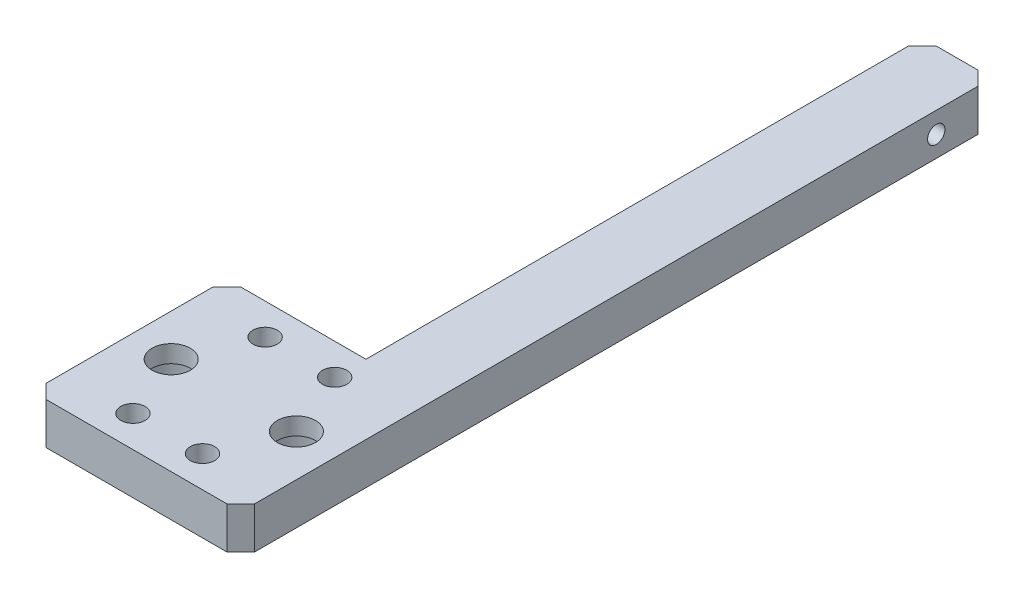
ISO-10303-21;
HEADER;
FILE_DESCRIPTION(('STEP AP214'),'2;1');
FILE_NAME('part.step','',(''),(''),'','','');
FILE_SCHEMA(('AUTOMOTIVE_DESIGN { 1 0 10303 214 1 1 1 1 }'));
ENDSEC;
DATA;
#1=APPLICATION_CONTEXT('core data for automotive mechanical design processes');
#2=APPLICATION_PROTOCOL_DEFINITION('international standard','automotive_design',2000,#1);
#3=PRODUCT_CONTEXT('',#1,'mechanical');
#4=PRODUCT('Part','Part','',(#3));
#5=PRODUCT_RELATED_PRODUCT_CATEGORY('part','',(#4));
#6=PRODUCT_DEFINITION_FORMATION('','',#4);
#7=PRODUCT_DEFINITION_CONTEXT('part definition',#1,'design');
#8=PRODUCT_DEFINITION('design','',#6,#7);
#9=PRODUCT_DEFINITION_SHAPE('','',#8);
#10=(LENGTH_UNIT() NAMED_UNIT(*) SI_UNIT(.MILLI.,.METRE.));
#11=(NAMED_UNIT(*) PLANE_ANGLE_UNIT() SI_UNIT($,.RADIAN.));
#12=(NAMED_UNIT(*) SI_UNIT($,.STERADIAN.) SOLID_ANGLE_UNIT());
#13=UNCERTAINTY_MEASURE_WITH_UNIT(LENGTH_MEASURE(1.E-05),#10,'distance_accuracy_value','');
#14=(GEOMETRIC_REPRESENTATION_CONTEXT(3) GLOBAL_UNCERTAINTY_ASSIGNED_CONTEXT((#13)) GLOBAL_UNIT_ASSIGNED_CONTEXT((#10,
#11,#12)) REPRESENTATION_CONTEXT('',''));
#15=CARTESIAN_POINT('',(0.,0.,0.));
#16=DIRECTION('',(0.,0.,1.));
#17=DIRECTION('',(1.,0.,0.));
#18=AXIS2_PLACEMENT_3D('',#15,#16,#17);
#19=CARTESIAN_POINT('',(9.,-3.5,0.));
#20=DIRECTION('',(0.,1.,0.));
#21=DIRECTION('',(0.,0.,1.));
#22=AXIS2_PLACEMENT_3D('',#19,#20,#21);
#23=CYLINDRICAL_SURFACE('',#22,2.74999999999999);
#24=CARTESIAN_POINT('',(9.,6.,0.));
#25=DIRECTION('',(0.,-1.,0.));
#26=DIRECTION('',(0.,0.,1.));
#27=AXIS2_PLACEMENT_3D('',#24,#25,#26);
#28=CIRCLE('',#27,2.74999999999999);
#29=CARTESIAN_POINT('',(9.,6.,2.75));
#30=VERTEX_POINT('',#29);
#31=EDGE_CURVE('E148',#30,#30,#28,.T.);
#32=ORIENTED_EDGE('',*,*,#31,.F.);
#33=EDGE_LOOP('',(#32));
#34=FACE_BOUND('',#33,.T.);
#35=CARTESIAN_POINT('',(9.,3.5,0.));
#36=DIRECTION('',(0.,-1.,0.));
#37=DIRECTION('',(0.,0.,-1.));
#38=AXIS2_PLACEMENT_3D('',#35,#36,#37);
#39=CIRCLE('',#38,2.74999999999999);
#40=CARTESIAN_POINT('',(9.,3.5,-2.74999999999999));
#41=VERTEX_POINT('',#40);
#42=EDGE_CURVE('E201',#41,#41,#39,.T.);
#43=ORIENTED_EDGE('',*,*,#42,.T.);
#44=EDGE_LOOP('',(#43));
#45=FACE_BOUND('',#44,.T.);
#46=ADVANCED_FACE('F38',(#34,#45),#23,.F.);
#47=CARTESIAN_POINT('',(-9.,-3.5,0.));
#48=DIRECTION('',(0.,1.,0.));
#49=DIRECTION('',(0.,0.,1.));
#50=AXIS2_PLACEMENT_3D('',#47,#48,#49);
#51=CYLINDRICAL_SURFACE('',#50,2.75);
#52=CARTESIAN_POINT('',(-9.,6.,0.));
#53=DIRECTION('',(0.,-1.,0.));
#54=DIRECTION('',(0.,0.,-1.));
#55=AXIS2_PLACEMENT_3D('',#52,#53,#54);
#56=CIRCLE('',#55,2.75);
#57=CARTESIAN_POINT('',(-9.,6.,-2.75));
#58=VERTEX_POINT('',#57);
#59=EDGE_CURVE('E151',#58,#58,#56,.T.);
#60=ORIENTED_EDGE('',*,*,#59,.F.);
#61=EDGE_LOOP('',(#60));
#62=FACE_BOUND('',#61,.T.);
#63=CARTESIAN_POINT('',(-9.,3.5,0.));
#64=DIRECTION('',(0.,-1.,0.));
#65=DIRECTION('',(0.,0.,-1.));
#66=AXIS2_PLACEMENT_3D('',#63,#64,#65);
#67=CIRCLE('',#66,2.75);
#68=CARTESIAN_POINT('',(-9.,3.5,-2.75));
#69=VERTEX_POINT('',#68);
#70=EDGE_CURVE('E198',#69,#69,#67,.T.);
#71=ORIENTED_EDGE('',*,*,#70,.T.);
#72=EDGE_LOOP('',(#71));
#73=FACE_BOUND('',#72,.T.);
#74=ADVANCED_FACE('F305',(#62,#73),#51,.F.);
#75=CARTESIAN_POINT('',(-15.,6.,-14.));
#76=DIRECTION('',(0.,0.,1.));
#77=DIRECTION('',(1.,0.,0.));
#78=AXIS2_PLACEMENT_3D('',#75,#76,#77);
#79=PLANE('',#78);
#80=DIRECTION('',(-1.,0.,0.));
#81=VECTOR('',#80,1.);
#82=CARTESIAN_POINT('',(-15.,0.,-14.));
#83=LINE('',#82,#81);
#84=CARTESIAN_POINT('',(5.,0.,-14.));
#85=VERTEX_POINT('',#84);
#86=CARTESIAN_POINT('',(-13.,0.,-14.));
#87=VERTEX_POINT('',#86);
#88=EDGE_CURVE('E192',#85,#87,#83,.T.);
#89=ORIENTED_EDGE('',*,*,#88,.T.);
#90=DIRECTION('',(0.,1.,0.));
#91=VECTOR('',#90,1.);
#92=CARTESIAN_POINT('',(-13.,6.,-14.));
#93=LINE('',#92,#91);
#94=CARTESIAN_POINT('',(-13.,6.,-14.));
#95=VERTEX_POINT('',#94);
#96=EDGE_CURVE('E141',#87,#95,#93,.T.);
#97=ORIENTED_EDGE('',*,*,#96,.T.);
#98=DIRECTION('',(-1.,0.,0.));
#99=VECTOR('',#98,1.);
#100=CARTESIAN_POINT('',(-15.,6.,-14.));
#101=LINE('',#100,#99);
#102=CARTESIAN_POINT('',(4.99999999999999,6.,-14.));
#103=VERTEX_POINT('',#102);
#104=EDGE_CURVE('E124',#103,#95,#101,.T.);
#105=ORIENTED_EDGE('',*,*,#104,.F.);
#106=DIRECTION('',(0.,1.,0.));
#107=VECTOR('',#106,1.);
#108=CARTESIAN_POINT('',(4.99999999999999,0.,-14.));
#109=LINE('',#108,#107);
#110=EDGE_CURVE('E138',#85,#103,#109,.T.);
#111=ORIENTED_EDGE('',*,*,#110,.F.);
#112=EDGE_LOOP('',(#89,#97,#105,#111));
#113=FACE_BOUND('',#112,.T.);
#114=ADVANCED_FACE('F137',(#113),#79,.F.);
#115=CARTESIAN_POINT('',(15.,6.,-14.));
#116=DIRECTION('',(-1.,0.,0.));
#117=DIRECTION('',(0.,0.,1.));
#118=AXIS2_PLACEMENT_3D('',#115,#116,#117);
#119=PLANE('',#118);
#120=CARTESIAN_POINT('',(15.,3.,-86.));
#121=DIRECTION('',(-1.,0.,0.));
#122=DIRECTION('',(0.,0.,1.));
#123=AXIS2_PLACEMENT_3D('',#120,#121,#122);
#124=CIRCLE('',#123,1.25);
#125=CARTESIAN_POINT('',(15.,3.,-84.75));
#126=VERTEX_POINT('',#125);
#127=EDGE_CURVE('E274',#126,#126,#124,.F.);
#128=ORIENTED_EDGE('',*,*,#127,.F.);
#129=EDGE_LOOP('',(#128));
#130=FACE_BOUND('',#129,.T.);
#131=DIRECTION('',(0.,0.,-1.));
#132=VECTOR('',#131,1.);
#133=CARTESIAN_POINT('',(15.,0.,-14.));
#134=LINE('',#133,#132);
#135=CARTESIAN_POINT('',(15.,0.,12.));
#136=VERTEX_POINT('',#135);
#137=CARTESIAN_POINT('',(15.,0.,-92.));
#138=VERTEX_POINT('',#137);
#139=EDGE_CURVE('E180',#136,#138,#134,.T.);
#140=ORIENTED_EDGE('',*,*,#139,.T.);
#141=DIRECTION('',(0.,1.,0.));
#142=VECTOR('',#141,1.);
#143=CARTESIAN_POINT('',(15.,6.,-92.));
#144=LINE('',#143,#142);
#145=CARTESIAN_POINT('',(15.,6.,-92.));
#146=VERTEX_POINT('',#145);
#147=EDGE_CURVE('E238',#138,#146,#144,.T.);
#148=ORIENTED_EDGE('',*,*,#147,.T.);
#149=DIRECTION('',(0.,0.,-1.));
#150=VECTOR('',#149,1.);
#151=CARTESIAN_POINT('',(15.,6.,-14.));
#152=LINE('',#151,#150);
#153=CARTESIAN_POINT('',(15.,6.,12.));
#154=VERTEX_POINT('',#153);
#155=EDGE_CURVE('E143',#154,#146,#152,.T.);
#156=ORIENTED_EDGE('',*,*,#155,.F.);
#157=DIRECTION('',(0.,-1.,0.));
#158=VECTOR('',#157,1.);
#159=CARTESIAN_POINT('',(15.,6.,12.));
#160=LINE('',#159,#158);
#161=EDGE_CURVE('E235',#154,#136,#160,.T.);
#162=ORIENTED_EDGE('',*,*,#161,.T.);
#163=EDGE_LOOP('',(#140,#148,#156,#162));
#164=FACE_BOUND('',#163,.T.);
#165=ADVANCED_FACE('F255',(#130,#164),#119,.F.);
#166=CARTESIAN_POINT('',(-15.,6.,-14.));
#167=DIRECTION('',(1.,0.,0.));
#168=DIRECTION('',(0.,0.,-1.));
#169=AXIS2_PLACEMENT_3D('',#166,#167,#168);
#170=PLANE('',#169);
#171=DIRECTION('',(0.,0.,1.));
#172=VECTOR('',#171,1.);
#173=CARTESIAN_POINT('',(-15.,6.,-14.));
#174=LINE('',#173,#172);
#175=CARTESIAN_POINT('',(-15.,6.,-12.));
#176=VERTEX_POINT('',#175);
#177=CARTESIAN_POINT('',(-15.,6.,12.));
#178=VERTEX_POINT('',#177);
#179=EDGE_CURVE('E142',#176,#178,#174,.T.);
#180=ORIENTED_EDGE('',*,*,#179,.F.);
#181=DIRECTION('',(0.,-1.,0.));
#182=VECTOR('',#181,1.);
#183=CARTESIAN_POINT('',(-15.,6.,-12.));
#184=LINE('',#183,#182);
#185=CARTESIAN_POINT('',(-15.,0.,-12.));
#186=VERTEX_POINT('',#185);
#187=EDGE_CURVE('E206',#176,#186,#184,.T.);
#188=ORIENTED_EDGE('',*,*,#187,.T.);
#189=DIRECTION('',(0.,0.,1.));
#190=VECTOR('',#189,1.);
#191=CARTESIAN_POINT('',(-15.,0.,-14.));
#192=LINE('',#191,#190);
#193=CARTESIAN_POINT('',(-15.,0.,12.));
#194=VERTEX_POINT('',#193);
#195=EDGE_CURVE('E194',#186,#194,#192,.T.);
#196=ORIENTED_EDGE('',*,*,#195,.T.);
#197=DIRECTION('',(0.,1.,0.));
#198=VECTOR('',#197,1.);
#199=CARTESIAN_POINT('',(-15.,6.,12.));
#200=LINE('',#199,#198);
#201=EDGE_CURVE('E189',#194,#178,#200,.T.);
#202=ORIENTED_EDGE('',*,*,#201,.T.);
#203=EDGE_LOOP('',(#180,#188,#196,#202));
#204=FACE_BOUND('',#203,.T.);
#205=ADVANCED_FACE('F339',(#204),#170,.F.);
#206=CARTESIAN_POINT('',(-15.,6.,14.));
#207=DIRECTION('',(0.,0.,-1.));
#208=DIRECTION('',(-1.,0.,0.));
#209=AXIS2_PLACEMENT_3D('',#206,#207,#208);
#210=PLANE('',#209);
#211=DIRECTION('',(1.,0.,0.));
#212=VECTOR('',#211,1.);
#213=CARTESIAN_POINT('',(-15.,0.,14.));
#214=LINE('',#213,#212);
#215=CARTESIAN_POINT('',(-13.,0.,14.));
#216=VERTEX_POINT('',#215);
#217=CARTESIAN_POINT('',(13.,0.,14.));
#218=VERTEX_POINT('',#217);
#219=EDGE_CURVE('E184',#216,#218,#214,.T.);
#220=ORIENTED_EDGE('',*,*,#219,.T.);
#221=DIRECTION('',(0.,1.,0.));
#222=VECTOR('',#221,1.);
#223=CARTESIAN_POINT('',(13.,6.,14.));
#224=LINE('',#223,#222);
#225=CARTESIAN_POINT('',(13.,6.,14.));
#226=VERTEX_POINT('',#225);
#227=EDGE_CURVE('E11',#218,#226,#224,.T.);
#228=ORIENTED_EDGE('',*,*,#227,.T.);
#229=DIRECTION('',(1.,0.,0.));
#230=VECTOR('',#229,1.);
#231=CARTESIAN_POINT('',(-15.,6.,14.));
#232=LINE('',#231,#230);
#233=CARTESIAN_POINT('',(-13.,6.,14.));
#234=VERTEX_POINT('',#233);
#235=EDGE_CURVE('E187',#234,#226,#232,.T.);
#236=ORIENTED_EDGE('',*,*,#235,.F.);
#237=DIRECTION('',(0.,-1.,0.));
#238=VECTOR('',#237,1.);
#239=CARTESIAN_POINT('',(-13.,6.,14.));
#240=LINE('',#239,#238);
#241=EDGE_CURVE('E47',#234,#216,#240,.T.);
#242=ORIENTED_EDGE('',*,*,#241,.T.);
#243=EDGE_LOOP('',(#220,#228,#236,#242));
#244=FACE_BOUND('',#243,.T.);
#245=ADVANCED_FACE('F243',(#244),#210,.F.);
#246=CARTESIAN_POINT('',(0.,6.,0.));
#247=DIRECTION('',(0.,1.,0.));
#248=DIRECTION('',(0.,0.,1.));
#249=AXIS2_PLACEMENT_3D('',#246,#247,#248);
#250=PLANE('',#249);
#251=ORIENTED_EDGE('',*,*,#59,.T.);
#252=EDGE_LOOP('',(#251));
#253=FACE_BOUND('',#252,.T.);
#254=ORIENTED_EDGE('',*,*,#31,.T.);
#255=EDGE_LOOP('',(#254));
#256=FACE_BOUND('',#255,.T.);
#257=CARTESIAN_POINT('',(5.,6.,-9.5));
#258=DIRECTION('',(0.,1.,0.));
#259=DIRECTION('',(0.,0.,-1.));
#260=AXIS2_PLACEMENT_3D('',#257,#258,#259);
#261=CIRCLE('',#260,1.75);
#262=CARTESIAN_POINT('',(5.,6.,-11.25));
#263=VERTEX_POINT('',#262);
#264=EDGE_CURVE('E169',#263,#263,#261,.T.);
#265=ORIENTED_EDGE('',*,*,#264,.F.);
#266=EDGE_LOOP('',(#265));
#267=FACE_BOUND('',#266,.T.);
#268=CARTESIAN_POINT('',(-5.,6.,9.5));
#269=DIRECTION('',(0.,1.,0.));
#270=DIRECTION('',(0.,0.,-1.));
#271=AXIS2_PLACEMENT_3D('',#268,#269,#270);
#272=CIRCLE('',#271,1.75);
#273=CARTESIAN_POINT('',(-5.,6.,7.75));
#274=VERTEX_POINT('',#273);
#275=EDGE_CURVE('E162',#274,#274,#272,.T.);
#276=ORIENTED_EDGE('',*,*,#275,.F.);
#277=EDGE_LOOP('',(#276));
#278=FACE_BOUND('',#277,.T.);
#279=CARTESIAN_POINT('',(5.,6.,9.5));
#280=DIRECTION('',(0.,1.,0.));
#281=DIRECTION('',(0.,0.,1.));
#282=AXIS2_PLACEMENT_3D('',#279,#280,#281);
#283=CIRCLE('',#282,1.75);
#284=CARTESIAN_POINT('',(5.,6.,11.25));
#285=VERTEX_POINT('',#284);
#286=EDGE_CURVE('E157',#285,#285,#283,.T.);
#287=ORIENTED_EDGE('',*,*,#286,.F.);
#288=EDGE_LOOP('',(#287));
#289=FACE_BOUND('',#288,.T.);
#290=CARTESIAN_POINT('',(-5.,6.,-9.5));
#291=DIRECTION('',(0.,1.,0.));
#292=DIRECTION('',(0.,0.,1.));
#293=AXIS2_PLACEMENT_3D('',#290,#291,#292);
#294=CIRCLE('',#293,1.75);
#295=CARTESIAN_POINT('',(-5.,6.,-7.75));
#296=VERTEX_POINT('',#295);
#297=EDGE_CURVE('E168',#296,#296,#294,.T.);
#298=ORIENTED_EDGE('',*,*,#297,.F.);
#299=EDGE_LOOP('',(#298));
#300=FACE_BOUND('',#299,.T.);
#301=ORIENTED_EDGE('',*,*,#104,.T.);
#302=DIRECTION('',(0.707106781186548,0.,-0.707106781186548));
#303=VECTOR('',#302,1.);
#304=CARTESIAN_POINT('',(-13.5,6.,-13.5));
#305=LINE('',#304,#303);
#306=EDGE_CURVE('E226',#95,#176,#305,.F.);
#307=ORIENTED_EDGE('',*,*,#306,.T.);
#308=ORIENTED_EDGE('',*,*,#179,.T.);
#309=DIRECTION('',(-0.707106781186545,0.,-0.70710678118655));
#310=VECTOR('',#309,1.);
#311=CARTESIAN_POINT('',(-13.5,6.,13.4999999999999));
#312=LINE('',#311,#310);
#313=EDGE_CURVE('E59',#178,#234,#312,.F.);
#314=ORIENTED_EDGE('',*,*,#313,.T.);
#315=ORIENTED_EDGE('',*,*,#235,.T.);
#316=DIRECTION('',(-0.70710678118655,0.,0.707106781186545));
#317=VECTOR('',#316,1.);
#318=CARTESIAN_POINT('',(13.4999999999999,6.,13.5));
#319=LINE('',#318,#317);
#320=EDGE_CURVE('E221',#226,#154,#319,.F.);
#321=ORIENTED_EDGE('',*,*,#320,.T.);
#322=ORIENTED_EDGE('',*,*,#155,.T.);
#323=DIRECTION('',(-0.707106781186552,0.,-0.707106781186543));
#324=VECTOR('',#323,1.);
#325=CARTESIAN_POINT('',(53.4999999999999,6.,-53.5000000000006));
#326=LINE('',#325,#324);
#327=CARTESIAN_POINT('',(13.,6.,-94.));
#328=VERTEX_POINT('',#327);
#329=EDGE_CURVE('E223',#146,#328,#326,.T.);
#330=ORIENTED_EDGE('',*,*,#329,.T.);
#331=DIRECTION('',(-1.,0.,0.));
#332=VECTOR('',#331,1.);
#333=CARTESIAN_POINT('',(15.,6.,-94.));
#334=LINE('',#333,#332);
#335=CARTESIAN_POINT('',(7.00000000000001,6.,-94.));
#336=VERTEX_POINT('',#335);
#337=EDGE_CURVE('E132',#328,#336,#334,.T.);
#338=ORIENTED_EDGE('',*,*,#337,.T.);
#339=DIRECTION('',(0.707106781186545,0.,-0.70710678118655));
#340=VECTOR('',#339,1.);
#341=CARTESIAN_POINT('',(-43.5,6.,-43.4999999999997));
#342=LINE('',#341,#340);
#343=CARTESIAN_POINT('',(4.99999999999999,6.,-92.));
#344=VERTEX_POINT('',#343);
#345=EDGE_CURVE('E127',#336,#344,#342,.F.);
#346=ORIENTED_EDGE('',*,*,#345,.T.);
#347=DIRECTION('',(0.,0.,1.));
#348=VECTOR('',#347,1.);
#349=CARTESIAN_POINT('',(4.99999999999999,6.,-64.));
#350=LINE('',#349,#348);
#351=EDGE_CURVE('E121',#344,#103,#350,.T.);
#352=ORIENTED_EDGE('',*,*,#351,.T.);
#353=EDGE_LOOP('',(#301,#307,#308,#314,#315,#321,#322,#330,#338,#346,#352));
#354=FACE_BOUND('',#353,.T.);
#355=ADVANCED_FACE('F123',(#253,#256,#267,#278,#289,#300,#354),#250,.T.);
#356=CARTESIAN_POINT('',(0.,0.,0.));
#357=DIRECTION('',(0.,1.,0.));
#358=DIRECTION('',(0.,0.,1.));
#359=AXIS2_PLACEMENT_3D('',#356,#357,#358);
#360=PLANE('',#359);
#361=CARTESIAN_POINT('',(-9.,0.,0.));
#362=DIRECTION('',(0.,-1.,0.));
#363=DIRECTION('',(0.,0.,-1.));
#364=AXIS2_PLACEMENT_3D('',#361,#362,#363);
#365=CIRCLE('',#364,5.);
#366=CARTESIAN_POINT('',(-9.,0.,-5.));
#367=VERTEX_POINT('',#366);
#368=EDGE_CURVE('E277',#367,#367,#365,.T.);
#369=ORIENTED_EDGE('',*,*,#368,.F.);
#370=EDGE_LOOP('',(#369));
#371=FACE_BOUND('',#370,.T.);
#372=CARTESIAN_POINT('',(9.,0.,0.));
#373=DIRECTION('',(0.,-1.,0.));
#374=DIRECTION('',(0.,0.,-1.));
#375=AXIS2_PLACEMENT_3D('',#372,#373,#374);
#376=CIRCLE('',#375,5.);
#377=CARTESIAN_POINT('',(9.,0.,-4.99999999999999));
#378=VERTEX_POINT('',#377);
#379=EDGE_CURVE('E270',#378,#378,#376,.T.);
#380=ORIENTED_EDGE('',*,*,#379,.F.);
#381=EDGE_LOOP('',(#380));
#382=FACE_BOUND('',#381,.T.);
#383=CARTESIAN_POINT('',(5.,0.,-9.5));
#384=DIRECTION('',(0.,1.,0.));
#385=DIRECTION('',(0.,0.,-1.));
#386=AXIS2_PLACEMENT_3D('',#383,#384,#385);
#387=CIRCLE('',#386,1.75);
#388=CARTESIAN_POINT('',(5.,0.,-11.25));
#389=VERTEX_POINT('',#388);
#390=EDGE_CURVE('E165',#389,#389,#387,.T.);
#391=ORIENTED_EDGE('',*,*,#390,.T.);
#392=EDGE_LOOP('',(#391));
#393=FACE_BOUND('',#392,.T.);
#394=CARTESIAN_POINT('',(-5.,0.,9.5));
#395=DIRECTION('',(0.,1.,0.));
#396=DIRECTION('',(0.,0.,-1.));
#397=AXIS2_PLACEMENT_3D('',#394,#395,#396);
#398=CIRCLE('',#397,1.75);
#399=CARTESIAN_POINT('',(-5.,0.,7.75));
#400=VERTEX_POINT('',#399);
#401=EDGE_CURVE('E172',#400,#400,#398,.T.);
#402=ORIENTED_EDGE('',*,*,#401,.T.);
#403=EDGE_LOOP('',(#402));
#404=FACE_BOUND('',#403,.T.);
#405=CARTESIAN_POINT('',(5.,0.,9.5));
#406=DIRECTION('',(0.,1.,0.));
#407=DIRECTION('',(0.,0.,1.));
#408=AXIS2_PLACEMENT_3D('',#405,#406,#407);
#409=CIRCLE('',#408,1.75);
#410=CARTESIAN_POINT('',(5.,0.,11.25));
#411=VERTEX_POINT('',#410);
#412=EDGE_CURVE('E159',#411,#411,#409,.T.);
#413=ORIENTED_EDGE('',*,*,#412,.T.);
#414=EDGE_LOOP('',(#413));
#415=FACE_BOUND('',#414,.T.);
#416=CARTESIAN_POINT('',(-5.,0.,-9.5));
#417=DIRECTION('',(0.,1.,0.));
#418=DIRECTION('',(0.,0.,1.));
#419=AXIS2_PLACEMENT_3D('',#416,#417,#418);
#420=CIRCLE('',#419,1.75);
#421=CARTESIAN_POINT('',(-5.,0.,-7.75));
#422=VERTEX_POINT('',#421);
#423=EDGE_CURVE('E177',#422,#422,#420,.T.);
#424=ORIENTED_EDGE('',*,*,#423,.T.);
#425=EDGE_LOOP('',(#424));
#426=FACE_BOUND('',#425,.T.);
#427=ORIENTED_EDGE('',*,*,#195,.F.);
#428=DIRECTION('',(-0.707106781186548,0.,0.707106781186548));
#429=VECTOR('',#428,1.);
#430=CARTESIAN_POINT('',(-15.,0.,-12.));
#431=LINE('',#430,#429);
#432=EDGE_CURVE('E217',#186,#87,#431,.F.);
#433=ORIENTED_EDGE('',*,*,#432,.T.);
#434=ORIENTED_EDGE('',*,*,#88,.F.);
#435=DIRECTION('',(0.,0.,1.));
#436=VECTOR('',#435,1.);
#437=CARTESIAN_POINT('',(4.99999999999999,0.,-94.));
#438=LINE('',#437,#436);
#439=CARTESIAN_POINT('',(4.99999999999999,0.,-92.));
#440=VERTEX_POINT('',#439);
#441=EDGE_CURVE('E147',#440,#85,#438,.T.);
#442=ORIENTED_EDGE('',*,*,#441,.F.);
#443=DIRECTION('',(-0.707106781186545,0.,0.70710678118655));
#444=VECTOR('',#443,1.);
#445=CARTESIAN_POINT('',(7.00000000000001,0.,-94.));
#446=LINE('',#445,#444);
#447=CARTESIAN_POINT('',(7.00000000000001,0.,-94.));
#448=VERTEX_POINT('',#447);
#449=EDGE_CURVE('E215',#440,#448,#446,.F.);
#450=ORIENTED_EDGE('',*,*,#449,.T.);
#451=DIRECTION('',(-1.,0.,0.));
#452=VECTOR('',#451,1.);
#453=CARTESIAN_POINT('',(15.,0.,-94.));
#454=LINE('',#453,#452);
#455=CARTESIAN_POINT('',(13.,0.,-94.));
#456=VERTEX_POINT('',#455);
#457=EDGE_CURVE('E131',#456,#448,#454,.T.);
#458=ORIENTED_EDGE('',*,*,#457,.F.);
#459=DIRECTION('',(0.707106781186552,0.,0.707106781186543));
#460=VECTOR('',#459,1.);
#461=CARTESIAN_POINT('',(15.,0.,-92.));
#462=LINE('',#461,#460);
#463=EDGE_CURVE('E213',#456,#138,#462,.T.);
#464=ORIENTED_EDGE('',*,*,#463,.T.);
#465=ORIENTED_EDGE('',*,*,#139,.F.);
#466=DIRECTION('',(0.70710678118655,0.,-0.707106781186545));
#467=VECTOR('',#466,1.);
#468=CARTESIAN_POINT('',(15.,0.,12.));
#469=LINE('',#468,#467);
#470=EDGE_CURVE('E211',#136,#218,#469,.F.);
#471=ORIENTED_EDGE('',*,*,#470,.T.);
#472=ORIENTED_EDGE('',*,*,#219,.F.);
#473=DIRECTION('',(0.707106781186545,0.,0.70710678118655));
#474=VECTOR('',#473,1.);
#475=CARTESIAN_POINT('',(-13.,0.,14.));
#476=LINE('',#475,#474);
#477=EDGE_CURVE('E209',#216,#194,#476,.F.);
#478=ORIENTED_EDGE('',*,*,#477,.T.);
#479=EDGE_LOOP('',(#427,#433,#434,#442,#450,#458,#464,#465,#471,#472,#478));
#480=FACE_BOUND('',#479,.T.);
#481=ADVANCED_FACE('F247',(#371,#382,#393,#404,#415,#426,#480),#360,.F.);
#482=CARTESIAN_POINT('',(-5.,0.,-9.5));
#483=DIRECTION('',(0.,1.,0.));
#484=DIRECTION('',(0.,0.,1.));
#485=AXIS2_PLACEMENT_3D('',#482,#483,#484);
#486=CYLINDRICAL_SURFACE('',#485,1.75);
#487=ORIENTED_EDGE('',*,*,#423,.F.);
#488=EDGE_LOOP('',(#487));
#489=FACE_BOUND('',#488,.T.);
#490=ORIENTED_EDGE('',*,*,#297,.T.);
#491=EDGE_LOOP('',(#490));
#492=FACE_BOUND('',#491,.T.);
#493=ADVANCED_FACE('F320',(#489,#492),#486,.F.);
#494=CARTESIAN_POINT('',(5.,0.,9.5));
#495=DIRECTION('',(0.,1.,0.));
#496=DIRECTION('',(0.,0.,1.));
#497=AXIS2_PLACEMENT_3D('',#494,#495,#496);
#498=CYLINDRICAL_SURFACE('',#497,1.75);
#499=ORIENTED_EDGE('',*,*,#412,.F.);
#500=EDGE_LOOP('',(#499));
#501=FACE_BOUND('',#500,.T.);
#502=ORIENTED_EDGE('',*,*,#286,.T.);
#503=EDGE_LOOP('',(#502));
#504=FACE_BOUND('',#503,.T.);
#505=ADVANCED_FACE('F316',(#501,#504),#498,.F.);
#506=CARTESIAN_POINT('',(-5.,0.,9.5));
#507=DIRECTION('',(0.,1.,0.));
#508=DIRECTION('',(0.,0.,1.));
#509=AXIS2_PLACEMENT_3D('',#506,#507,#508);
#510=CYLINDRICAL_SURFACE('',#509,1.75);
#511=ORIENTED_EDGE('',*,*,#401,.F.);
#512=EDGE_LOOP('',(#511));
#513=FACE_BOUND('',#512,.T.);
#514=ORIENTED_EDGE('',*,*,#275,.T.);
#515=EDGE_LOOP('',(#514));
#516=FACE_BOUND('',#515,.T.);
#517=ADVANCED_FACE('F319',(#513,#516),#510,.F.);
#518=CARTESIAN_POINT('',(5.,0.,-9.5));
#519=DIRECTION('',(0.,1.,0.));
#520=DIRECTION('',(0.,0.,1.));
#521=AXIS2_PLACEMENT_3D('',#518,#519,#520);
#522=CYLINDRICAL_SURFACE('',#521,1.75);
#523=ORIENTED_EDGE('',*,*,#390,.F.);
#524=EDGE_LOOP('',(#523));
#525=FACE_BOUND('',#524,.T.);
#526=ORIENTED_EDGE('',*,*,#264,.T.);
#527=EDGE_LOOP('',(#526));
#528=FACE_BOUND('',#527,.T.);
#529=ADVANCED_FACE('F301',(#525,#528),#522,.F.);
#530=CARTESIAN_POINT('',(15.,0.,-94.));
#531=DIRECTION('',(0.,0.,-1.));
#532=DIRECTION('',(-1.,0.,0.));
#533=AXIS2_PLACEMENT_3D('',#530,#531,#532);
#534=PLANE('',#533);
#535=ORIENTED_EDGE('',*,*,#457,.T.);
#536=DIRECTION('',(0.,1.,0.));
#537=VECTOR('',#536,1.);
#538=CARTESIAN_POINT('',(7.00000000000001,0.,-94.));
#539=LINE('',#538,#537);
#540=EDGE_CURVE('E230',#448,#336,#539,.T.);
#541=ORIENTED_EDGE('',*,*,#540,.T.);
#542=ORIENTED_EDGE('',*,*,#337,.F.);
#543=DIRECTION('',(0.,-1.,0.));
#544=VECTOR('',#543,1.);
#545=CARTESIAN_POINT('',(13.,0.,-94.));
#546=LINE('',#545,#544);
#547=EDGE_CURVE('E228',#328,#456,#546,.T.);
#548=ORIENTED_EDGE('',*,*,#547,.T.);
#549=EDGE_LOOP('',(#535,#541,#542,#548));
#550=FACE_BOUND('',#549,.T.);
#551=ADVANCED_FACE('F262',(#550),#534,.T.);
#552=CARTESIAN_POINT('',(4.99999999999999,0.,-64.));
#553=DIRECTION('',(-1.,0.,0.));
#554=DIRECTION('',(0.,0.,1.));
#555=AXIS2_PLACEMENT_3D('',#552,#553,#554);
#556=PLANE('',#555);
#557=CARTESIAN_POINT('',(4.99999999999998,3.,-86.));
#558=DIRECTION('',(-1.,0.,0.));
#559=DIRECTION('',(0.,0.,1.));
#560=AXIS2_PLACEMENT_3D('',#557,#558,#559);
#561=CIRCLE('',#560,1.25);
#562=CARTESIAN_POINT('',(4.99999999999998,3.,-84.75));
#563=VERTEX_POINT('',#562);
#564=EDGE_CURVE('E284',#563,#563,#561,.T.);
#565=ORIENTED_EDGE('',*,*,#564,.F.);
#566=EDGE_LOOP('',(#565));
#567=FACE_BOUND('',#566,.T.);
#568=ORIENTED_EDGE('',*,*,#351,.F.);
#569=DIRECTION('',(0.,-1.,0.));
#570=VECTOR('',#569,1.);
#571=CARTESIAN_POINT('',(4.99999999999999,0.,-92.));
#572=LINE('',#571,#570);
#573=EDGE_CURVE('E233',#344,#440,#572,.T.);
#574=ORIENTED_EDGE('',*,*,#573,.T.);
#575=ORIENTED_EDGE('',*,*,#441,.T.);
#576=ORIENTED_EDGE('',*,*,#110,.T.);
#577=EDGE_LOOP('',(#568,#574,#575,#576));
#578=FACE_BOUND('',#577,.T.);
#579=ADVANCED_FACE('F145',(#567,#578),#556,.T.);
#580=CARTESIAN_POINT('',(-9.,3.5,0.));
#581=DIRECTION('',(0.,-1.,0.));
#582=DIRECTION('',(0.,0.,-1.));
#583=AXIS2_PLACEMENT_3D('',#580,#581,#582);
#584=CYLINDRICAL_SURFACE('',#583,5.);
#585=CARTESIAN_POINT('',(-9.,3.5,0.));
#586=DIRECTION('',(0.,-1.,0.));
#587=DIRECTION('',(0.,0.,-1.));
#588=AXIS2_PLACEMENT_3D('',#585,#586,#587);
#589=CIRCLE('',#588,5.);
#590=CARTESIAN_POINT('',(-9.,3.5,-5.));
#591=VERTEX_POINT('',#590);
#592=EDGE_CURVE('E202',#591,#591,#589,.T.);
#593=ORIENTED_EDGE('',*,*,#592,.F.);
#594=EDGE_LOOP('',(#593));
#595=FACE_BOUND('',#594,.T.);
#596=ORIENTED_EDGE('',*,*,#368,.T.);
#597=EDGE_LOOP('',(#596));
#598=FACE_BOUND('',#597,.T.);
#599=ADVANCED_FACE('F292',(#595,#598),#584,.F.);
#600=CARTESIAN_POINT('',(-9.,3.5,0.));
#601=DIRECTION('',(0.,-1.,0.));
#602=DIRECTION('',(0.,0.,-1.));
#603=AXIS2_PLACEMENT_3D('',#600,#601,#602);
#604=PLANE('',#603);
#605=ORIENTED_EDGE('',*,*,#70,.F.);
#606=EDGE_LOOP('',(#605));
#607=FACE_BOUND('',#606,.T.);
#608=ORIENTED_EDGE('',*,*,#592,.T.);
#609=EDGE_LOOP('',(#608));
#610=FACE_BOUND('',#609,.T.);
#611=ADVANCED_FACE('F298',(#607,#610),#604,.T.);
#612=CARTESIAN_POINT('',(9.,3.5,0.));
#613=DIRECTION('',(0.,-1.,0.));
#614=DIRECTION('',(0.,0.,-1.));
#615=AXIS2_PLACEMENT_3D('',#612,#613,#614);
#616=CYLINDRICAL_SURFACE('',#615,5.);
#617=CARTESIAN_POINT('',(9.,3.5,0.));
#618=DIRECTION('',(0.,-1.,0.));
#619=DIRECTION('',(0.,0.,-1.));
#620=AXIS2_PLACEMENT_3D('',#617,#618,#619);
#621=CIRCLE('',#620,5.);
#622=CARTESIAN_POINT('',(9.,3.5,-4.99999999999999));
#623=VERTEX_POINT('',#622);
#624=EDGE_CURVE('E273',#623,#623,#621,.T.);
#625=ORIENTED_EDGE('',*,*,#624,.F.);
#626=EDGE_LOOP('',(#625));
#627=FACE_BOUND('',#626,.T.);
#628=ORIENTED_EDGE('',*,*,#379,.T.);
#629=EDGE_LOOP('',(#628));
#630=FACE_BOUND('',#629,.T.);
#631=ADVANCED_FACE('F385',(#627,#630),#616,.F.);
#632=CARTESIAN_POINT('',(9.,3.5,0.));
#633=DIRECTION('',(0.,-1.,0.));
#634=DIRECTION('',(0.,0.,-1.));
#635=AXIS2_PLACEMENT_3D('',#632,#633,#634);
#636=PLANE('',#635);
#637=ORIENTED_EDGE('',*,*,#42,.F.);
#638=EDGE_LOOP('',(#637));
#639=FACE_BOUND('',#638,.T.);
#640=ORIENTED_EDGE('',*,*,#624,.T.);
#641=EDGE_LOOP('',(#640));
#642=FACE_BOUND('',#641,.T.);
#643=ADVANCED_FACE('F356',(#639,#642),#636,.T.);
#644=CARTESIAN_POINT('',(-15.,6.,-12.));
#645=DIRECTION('',(0.707106781186547,0.,0.707106781186547));
#646=DIRECTION('',(0.,-1.,0.));
#647=AXIS2_PLACEMENT_3D('',#644,#645,#646);
#648=PLANE('',#647);
#649=ORIENTED_EDGE('',*,*,#306,.F.);
#650=ORIENTED_EDGE('',*,*,#96,.F.);
#651=ORIENTED_EDGE('',*,*,#432,.F.);
#652=ORIENTED_EDGE('',*,*,#187,.F.);
#653=EDGE_LOOP('',(#649,#650,#651,#652));
#654=FACE_BOUND('',#653,.T.);
#655=ADVANCED_FACE('F349',(#654),#648,.F.);
#656=CARTESIAN_POINT('',(7.00000000000001,0.,-94.));
#657=DIRECTION('',(0.70710678118655,0.,0.707106781186545));
#658=DIRECTION('',(0.,1.,0.));
#659=AXIS2_PLACEMENT_3D('',#656,#657,#658);
#660=PLANE('',#659);
#661=ORIENTED_EDGE('',*,*,#449,.F.);
#662=ORIENTED_EDGE('',*,*,#573,.F.);
#663=ORIENTED_EDGE('',*,*,#345,.F.);
#664=ORIENTED_EDGE('',*,*,#540,.F.);
#665=EDGE_LOOP('',(#661,#662,#663,#664));
#666=FACE_BOUND('',#665,.T.);
#667=ADVANCED_FACE('F355',(#666),#660,.F.);
#668=CARTESIAN_POINT('',(15.,6.,-92.));
#669=DIRECTION('',(0.707106781186543,0.,-0.707106781186552));
#670=DIRECTION('',(0.,-1.,0.));
#671=AXIS2_PLACEMENT_3D('',#668,#669,#670);
#672=PLANE('',#671);
#673=ORIENTED_EDGE('',*,*,#463,.F.);
#674=ORIENTED_EDGE('',*,*,#547,.F.);
#675=ORIENTED_EDGE('',*,*,#329,.F.);
#676=ORIENTED_EDGE('',*,*,#147,.F.);
#677=EDGE_LOOP('',(#673,#674,#675,#676));
#678=FACE_BOUND('',#677,.T.);
#679=ADVANCED_FACE('F266',(#678),#672,.T.);
#680=CARTESIAN_POINT('',(15.,6.,12.));
#681=DIRECTION('',(-0.707106781186545,0.,-0.70710678118655));
#682=DIRECTION('',(0.,-1.,0.));
#683=AXIS2_PLACEMENT_3D('',#680,#681,#682);
#684=PLANE('',#683);
#685=ORIENTED_EDGE('',*,*,#320,.F.);
#686=ORIENTED_EDGE('',*,*,#227,.F.);
#687=ORIENTED_EDGE('',*,*,#470,.F.);
#688=ORIENTED_EDGE('',*,*,#161,.F.);
#689=EDGE_LOOP('',(#685,#686,#687,#688));
#690=FACE_BOUND('',#689,.T.);
#691=ADVANCED_FACE('F252',(#690),#684,.F.);
#692=CARTESIAN_POINT('',(-13.,6.,14.));
#693=DIRECTION('',(0.70710678118655,0.,-0.707106781186545));
#694=DIRECTION('',(0.,-1.,0.));
#695=AXIS2_PLACEMENT_3D('',#692,#693,#694);
#696=PLANE('',#695);
#697=ORIENTED_EDGE('',*,*,#313,.F.);
#698=ORIENTED_EDGE('',*,*,#201,.F.);
#699=ORIENTED_EDGE('',*,*,#477,.F.);
#700=ORIENTED_EDGE('',*,*,#241,.F.);
#701=EDGE_LOOP('',(#697,#698,#699,#700));
#702=FACE_BOUND('',#701,.T.);
#703=ADVANCED_FACE('F41',(#702),#696,.F.);
#704=CARTESIAN_POINT('',(15.001,3.,-86.));
#705=DIRECTION('',(-1.,0.,0.));
#706=DIRECTION('',(0.,0.,1.));
#707=AXIS2_PLACEMENT_3D('',#704,#705,#706);
#708=CYLINDRICAL_SURFACE('',#707,1.25);
#709=ORIENTED_EDGE('',*,*,#564,.T.);
#710=EDGE_LOOP('',(#709));
#711=FACE_BOUND('',#710,.T.);
#712=ORIENTED_EDGE('',*,*,#127,.T.);
#713=EDGE_LOOP('',(#712));
#714=FACE_BOUND('',#713,.T.);
#715=ADVANCED_FACE('F288',(#711,#714),#708,.F.);
#716=CLOSED_SHELL('',(#46,#74,#114,#165,#205,#245,#355,#481,#493,#505,#517,#529,#551,#579,#599,
#611,#631,#643,#655,#667,#679,#691,#703,#715));
#717=MANIFOLD_SOLID_BREP('B2',#716);
#718=ADVANCED_BREP_SHAPE_REPRESENTATION('',(#18,#717),#14);
#719=SHAPE_DEFINITION_REPRESENTATION(#9,#718);
ENDSEC;
END-ISO-10303-21;
